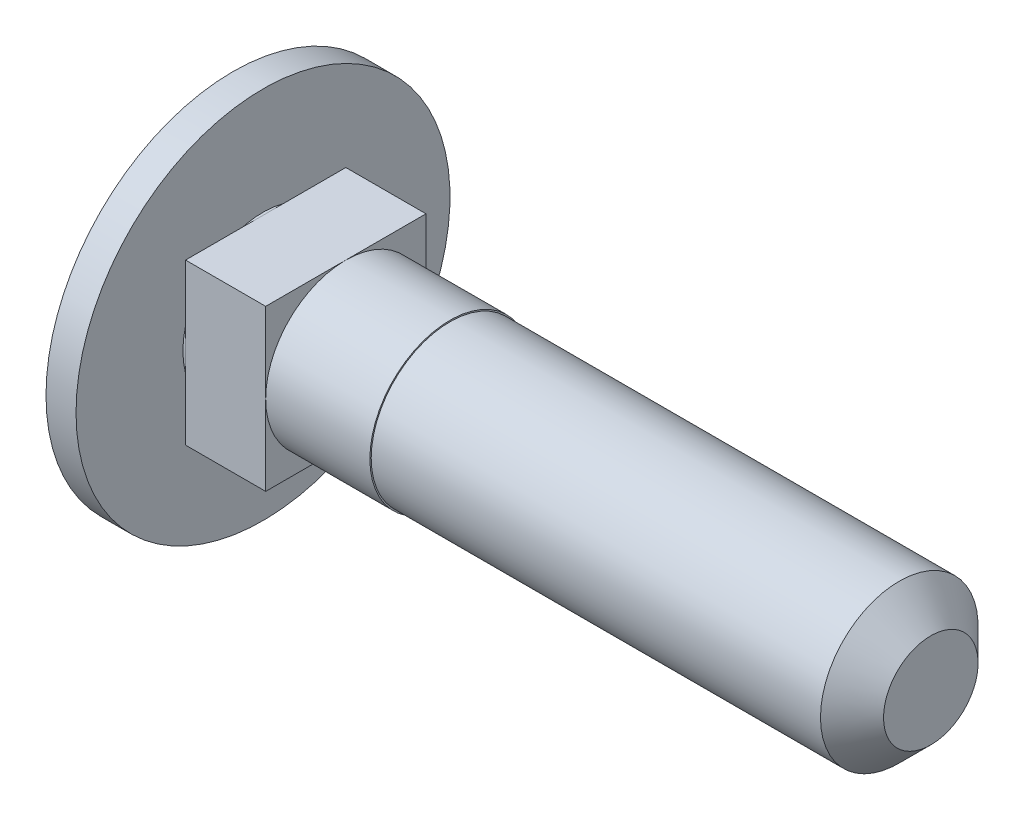
ISO-10303-21;
HEADER;
FILE_DESCRIPTION(('STEP AP214'),'2;1');
FILE_NAME('part.step','',(''),(''),'','','');
FILE_SCHEMA(('AUTOMOTIVE_DESIGN { 1 0 10303 214 1 1 1 1 }'));
ENDSEC;
DATA;
#1=APPLICATION_CONTEXT('core data for automotive mechanical design processes');
#2=APPLICATION_PROTOCOL_DEFINITION('international standard','automotive_design',2000,#1);
#3=PRODUCT_CONTEXT('',#1,'mechanical');
#4=PRODUCT('Part','Part','',(#3));
#5=PRODUCT_RELATED_PRODUCT_CATEGORY('part','',(#4));
#6=PRODUCT_DEFINITION_FORMATION('','',#4);
#7=PRODUCT_DEFINITION_CONTEXT('part definition',#1,'design');
#8=PRODUCT_DEFINITION('design','',#6,#7);
#9=PRODUCT_DEFINITION_SHAPE('','',#8);
#10=(LENGTH_UNIT() NAMED_UNIT(*) SI_UNIT(.MILLI.,.METRE.));
#11=(NAMED_UNIT(*) PLANE_ANGLE_UNIT() SI_UNIT($,.RADIAN.));
#12=(NAMED_UNIT(*) SI_UNIT($,.STERADIAN.) SOLID_ANGLE_UNIT());
#13=UNCERTAINTY_MEASURE_WITH_UNIT(LENGTH_MEASURE(1.E-05),#10,'distance_accuracy_value','');
#14=(GEOMETRIC_REPRESENTATION_CONTEXT(3) GLOBAL_UNCERTAINTY_ASSIGNED_CONTEXT((#13)) GLOBAL_UNIT_ASSIGNED_CONTEXT((#10,
#11,#12)) REPRESENTATION_CONTEXT('',''));
#15=CARTESIAN_POINT('',(0.,0.,0.));
#16=DIRECTION('',(0.,0.,1.));
#17=DIRECTION('',(1.,0.,0.));
#18=AXIS2_PLACEMENT_3D('',#15,#16,#17);
#19=CARTESIAN_POINT('',(25.,0.,0.));
#20=DIRECTION('',(-1.,0.,0.));
#21=DIRECTION('',(0.,0.,1.));
#22=AXIS2_PLACEMENT_3D('',#19,#20,#21);
#23=PLANE('',#22);
#24=CARTESIAN_POINT('',(25.,0.,0.));
#25=DIRECTION('',(-1.,0.,0.));
#26=DIRECTION('',(0.,0.,1.));
#27=AXIS2_PLACEMENT_3D('',#24,#25,#26);
#28=CIRCLE('',#27,1.77000000000004);
#29=CARTESIAN_POINT('',(25.,0.,1.77000000000004));
#30=VERTEX_POINT('',#29);
#31=EDGE_CURVE('E11',#30,#30,#28,.F.);
#32=ORIENTED_EDGE('',*,*,#31,.T.);
#33=EDGE_LOOP('',(#32));
#34=FACE_BOUND('',#33,.T.);
#35=ADVANCED_FACE('F36',(#34),#23,.F.);
#36=CARTESIAN_POINT('',(-121.430503084695,0.,0.));
#37=DIRECTION('',(-1.,0.,0.));
#38=DIRECTION('',(0.,0.,1.));
#39=AXIS2_PLACEMENT_3D('',#36,#37,#38);
#40=CYLINDRICAL_SURFACE('',#39,2.95000000000001);
#41=CARTESIAN_POINT('',(23.82,0.,0.));
#42=DIRECTION('',(-1.,0.,0.));
#43=DIRECTION('',(0.,0.,1.));
#44=AXIS2_PLACEMENT_3D('',#41,#42,#43);
#45=CIRCLE('',#44,2.95000000000001);
#46=CARTESIAN_POINT('',(23.82,0.,2.95000000000001));
#47=VERTEX_POINT('',#46);
#48=EDGE_CURVE('E44',#47,#47,#45,.T.);
#49=ORIENTED_EDGE('',*,*,#48,.T.);
#50=EDGE_LOOP('',(#49));
#51=FACE_BOUND('',#50,.T.);
#52=CARTESIAN_POINT('',(6.99999999999999,0.,0.));
#53=DIRECTION('',(-1.,0.,0.));
#54=DIRECTION('',(0.,0.,1.));
#55=AXIS2_PLACEMENT_3D('',#52,#53,#54);
#56=CIRCLE('',#55,2.95);
#57=CARTESIAN_POINT('',(6.99999999999999,0.,2.95));
#58=VERTEX_POINT('',#57);
#59=EDGE_CURVE('E146',#58,#58,#56,.T.);
#60=ORIENTED_EDGE('',*,*,#59,.F.);
#61=EDGE_LOOP('',(#60));
#62=FACE_BOUND('',#61,.T.);
#63=ADVANCED_FACE('F225',(#51,#62),#40,.T.);
#64=CARTESIAN_POINT('',(7.,2.95,0.));
#65=DIRECTION('',(-1.,0.,0.));
#66=DIRECTION('',(0.,0.,1.));
#67=AXIS2_PLACEMENT_3D('',#64,#65,#66);
#68=PLANE('',#67);
#69=CARTESIAN_POINT('',(6.99999999999999,0.,0.));
#70=DIRECTION('',(-1.,0.,0.));
#71=DIRECTION('',(0.,0.,1.));
#72=AXIS2_PLACEMENT_3D('',#69,#70,#71);
#73=CIRCLE('',#72,3.);
#74=CARTESIAN_POINT('',(6.99999999999999,0.,3.));
#75=VERTEX_POINT('',#74);
#76=EDGE_CURVE('E143',#75,#75,#73,.T.);
#77=ORIENTED_EDGE('',*,*,#76,.F.);
#78=EDGE_LOOP('',(#77));
#79=FACE_BOUND('',#78,.T.);
#80=ORIENTED_EDGE('',*,*,#59,.T.);
#81=EDGE_LOOP('',(#80));
#82=FACE_BOUND('',#81,.T.);
#83=ADVANCED_FACE('F230',(#79,#82),#68,.F.);
#84=CARTESIAN_POINT('',(-121.430503084695,0.,0.));
#85=DIRECTION('',(-1.,0.,0.));
#86=DIRECTION('',(0.,0.,1.));
#87=AXIS2_PLACEMENT_3D('',#84,#85,#86);
#88=CYLINDRICAL_SURFACE('',#87,3.00000000000001);
#89=CARTESIAN_POINT('',(3.10000000000001,0.,0.));
#90=DIRECTION('',(1.,0.,0.));
#91=DIRECTION('',(0.,0.,-1.));
#92=AXIS2_PLACEMENT_3D('',#89,#90,#91);
#93=CIRCLE('',#92,3.00000000000001);
#94=CARTESIAN_POINT('',(3.10000000000001,-3.,0.));
#95=VERTEX_POINT('',#94);
#96=CARTESIAN_POINT('',(3.10000000000001,0.,-3.00000000000001));
#97=VERTEX_POINT('',#96);
#98=EDGE_CURVE('E154',#95,#97,#93,.T.);
#99=ORIENTED_EDGE('',*,*,#98,.T.);
#100=CARTESIAN_POINT('',(3.10000000000001,3.,0.));
#101=VERTEX_POINT('',#100);
#102=EDGE_CURVE('E106',#97,#101,#93,.T.);
#103=ORIENTED_EDGE('',*,*,#102,.T.);
#104=CARTESIAN_POINT('',(3.10000000000001,0.,3.));
#105=VERTEX_POINT('',#104);
#106=EDGE_CURVE('E159',#101,#105,#93,.T.);
#107=ORIENTED_EDGE('',*,*,#106,.T.);
#108=EDGE_CURVE('E155',#105,#95,#93,.T.);
#109=ORIENTED_EDGE('',*,*,#108,.T.);
#110=EDGE_LOOP('',(#99,#103,#107,#109));
#111=FACE_BOUND('',#110,.T.);
#112=ORIENTED_EDGE('',*,*,#76,.T.);
#113=EDGE_LOOP('',(#112));
#114=FACE_BOUND('',#113,.T.);
#115=ADVANCED_FACE('F163',(#111,#114),#88,.T.);
#116=CARTESIAN_POINT('',(3.1,3.,-3.));
#117=DIRECTION('',(0.,0.,1.));
#118=DIRECTION('',(0.,-1.,0.));
#119=AXIS2_PLACEMENT_3D('',#116,#117,#118);
#120=PLANE('',#119);
#121=DIRECTION('',(0.,1.,0.));
#122=VECTOR('',#121,1.);
#123=CARTESIAN_POINT('',(3.1,3.,-3.));
#124=LINE('',#123,#122);
#125=CARTESIAN_POINT('',(3.1,3.,-3.));
#126=VERTEX_POINT('',#125);
#127=EDGE_CURVE('E101',#97,#126,#124,.T.);
#128=ORIENTED_EDGE('',*,*,#127,.F.);
#129=CARTESIAN_POINT('',(3.1,-3.,-3.));
#130=VERTEX_POINT('',#129);
#131=EDGE_CURVE('E51',#130,#97,#124,.T.);
#132=ORIENTED_EDGE('',*,*,#131,.F.);
#133=DIRECTION('',(-1.,0.,0.));
#134=VECTOR('',#133,1.);
#135=CARTESIAN_POINT('',(3.1,-3.,-3.));
#136=LINE('',#135,#134);
#137=CARTESIAN_POINT('',(0.1,-3.,-3.));
#138=VERTEX_POINT('',#137);
#139=EDGE_CURVE('E184',#130,#138,#136,.T.);
#140=ORIENTED_EDGE('',*,*,#139,.T.);
#141=DIRECTION('',(0.,1.,0.));
#142=VECTOR('',#141,1.);
#143=CARTESIAN_POINT('',(0.1,3.,-3.));
#144=LINE('',#143,#142);
#145=CARTESIAN_POINT('',(0.100000000000003,0.,-3.));
#146=VERTEX_POINT('',#145);
#147=EDGE_CURVE('E185',#138,#146,#144,.T.);
#148=ORIENTED_EDGE('',*,*,#147,.T.);
#149=CARTESIAN_POINT('',(0.1,3.,-3.));
#150=VERTEX_POINT('',#149);
#151=EDGE_CURVE('E125',#146,#150,#144,.T.);
#152=ORIENTED_EDGE('',*,*,#151,.T.);
#153=DIRECTION('',(-1.,0.,0.));
#154=VECTOR('',#153,1.);
#155=CARTESIAN_POINT('',(3.1,3.,-3.));
#156=LINE('',#155,#154);
#157=EDGE_CURVE('E117',#126,#150,#156,.T.);
#158=ORIENTED_EDGE('',*,*,#157,.F.);
#159=EDGE_LOOP('',(#128,#132,#140,#148,#152,#158));
#160=FACE_BOUND('',#159,.T.);
#161=ADVANCED_FACE('F122',(#160),#120,.F.);
#162=CARTESIAN_POINT('',(3.1,3.,3.));
#163=DIRECTION('',(0.,-1.,0.));
#164=DIRECTION('',(0.,0.,-1.));
#165=AXIS2_PLACEMENT_3D('',#162,#163,#164);
#166=PLANE('',#165);
#167=DIRECTION('',(0.,0.,1.));
#168=VECTOR('',#167,1.);
#169=CARTESIAN_POINT('',(3.1,3.,3.));
#170=LINE('',#169,#168);
#171=CARTESIAN_POINT('',(3.1,3.,3.));
#172=VERTEX_POINT('',#171);
#173=EDGE_CURVE('E119',#101,#172,#170,.T.);
#174=ORIENTED_EDGE('',*,*,#173,.F.);
#175=EDGE_CURVE('E104',#126,#101,#170,.T.);
#176=ORIENTED_EDGE('',*,*,#175,.F.);
#177=ORIENTED_EDGE('',*,*,#157,.T.);
#178=DIRECTION('',(0.,0.,1.));
#179=VECTOR('',#178,1.);
#180=CARTESIAN_POINT('',(0.1,3.,3.));
#181=LINE('',#180,#179);
#182=CARTESIAN_POINT('',(0.100000000000003,3.,0.));
#183=VERTEX_POINT('',#182);
#184=EDGE_CURVE('E188',#150,#183,#181,.T.);
#185=ORIENTED_EDGE('',*,*,#184,.T.);
#186=CARTESIAN_POINT('',(0.1,3.,3.));
#187=VERTEX_POINT('',#186);
#188=EDGE_CURVE('E187',#183,#187,#181,.T.);
#189=ORIENTED_EDGE('',*,*,#188,.T.);
#190=DIRECTION('',(-1.,0.,0.));
#191=VECTOR('',#190,1.);
#192=CARTESIAN_POINT('',(3.1,3.,3.));
#193=LINE('',#192,#191);
#194=EDGE_CURVE('E128',#172,#187,#193,.T.);
#195=ORIENTED_EDGE('',*,*,#194,.F.);
#196=EDGE_LOOP('',(#174,#176,#177,#185,#189,#195));
#197=FACE_BOUND('',#196,.T.);
#198=ADVANCED_FACE('F115',(#197),#166,.F.);
#199=CARTESIAN_POINT('',(3.1,3.,3.));
#200=DIRECTION('',(0.,0.,-1.));
#201=DIRECTION('',(0.,1.,0.));
#202=AXIS2_PLACEMENT_3D('',#199,#200,#201);
#203=PLANE('',#202);
#204=DIRECTION('',(0.,-1.,0.));
#205=VECTOR('',#204,1.);
#206=CARTESIAN_POINT('',(3.1,3.,3.));
#207=LINE('',#206,#205);
#208=CARTESIAN_POINT('',(3.1,-3.,3.));
#209=VERTEX_POINT('',#208);
#210=EDGE_CURVE('E120',#105,#209,#207,.T.);
#211=ORIENTED_EDGE('',*,*,#210,.F.);
#212=EDGE_CURVE('E176',#172,#105,#207,.T.);
#213=ORIENTED_EDGE('',*,*,#212,.F.);
#214=ORIENTED_EDGE('',*,*,#194,.T.);
#215=DIRECTION('',(0.,-1.,0.));
#216=VECTOR('',#215,1.);
#217=CARTESIAN_POINT('',(0.1,3.,3.));
#218=LINE('',#217,#216);
#219=CARTESIAN_POINT('',(0.100000000000003,0.,3.));
#220=VERTEX_POINT('',#219);
#221=EDGE_CURVE('E191',#187,#220,#218,.T.);
#222=ORIENTED_EDGE('',*,*,#221,.T.);
#223=CARTESIAN_POINT('',(0.1,-3.,3.));
#224=VERTEX_POINT('',#223);
#225=EDGE_CURVE('E190',#220,#224,#218,.T.);
#226=ORIENTED_EDGE('',*,*,#225,.T.);
#227=DIRECTION('',(-1.,0.,0.));
#228=VECTOR('',#227,1.);
#229=CARTESIAN_POINT('',(3.1,-3.,3.));
#230=LINE('',#229,#228);
#231=EDGE_CURVE('E134',#209,#224,#230,.T.);
#232=ORIENTED_EDGE('',*,*,#231,.F.);
#233=EDGE_LOOP('',(#211,#213,#214,#222,#226,#232));
#234=FACE_BOUND('',#233,.T.);
#235=ADVANCED_FACE('F175',(#234),#203,.F.);
#236=CARTESIAN_POINT('',(3.1,-3.,3.));
#237=DIRECTION('',(0.,1.,0.));
#238=DIRECTION('',(0.,0.,1.));
#239=AXIS2_PLACEMENT_3D('',#236,#237,#238);
#240=PLANE('',#239);
#241=DIRECTION('',(0.,0.,-1.));
#242=VECTOR('',#241,1.);
#243=CARTESIAN_POINT('',(3.1,-3.,3.));
#244=LINE('',#243,#242);
#245=EDGE_CURVE('E181',#95,#130,#244,.T.);
#246=ORIENTED_EDGE('',*,*,#245,.F.);
#247=EDGE_CURVE('E171',#209,#95,#244,.T.);
#248=ORIENTED_EDGE('',*,*,#247,.F.);
#249=ORIENTED_EDGE('',*,*,#231,.T.);
#250=DIRECTION('',(0.,0.,-1.));
#251=VECTOR('',#250,1.);
#252=CARTESIAN_POINT('',(0.1,-3.,3.));
#253=LINE('',#252,#251);
#254=CARTESIAN_POINT('',(0.100000000000003,-3.,0.));
#255=VERTEX_POINT('',#254);
#256=EDGE_CURVE('E110',#224,#255,#253,.T.);
#257=ORIENTED_EDGE('',*,*,#256,.T.);
#258=EDGE_CURVE('E194',#255,#138,#253,.T.);
#259=ORIENTED_EDGE('',*,*,#258,.T.);
#260=ORIENTED_EDGE('',*,*,#139,.F.);
#261=EDGE_LOOP('',(#246,#248,#249,#257,#259,#260));
#262=FACE_BOUND('',#261,.T.);
#263=ADVANCED_FACE('F201',(#262),#240,.F.);
#264=CARTESIAN_POINT('',(3.1,0.,0.));
#265=DIRECTION('',(1.,0.,0.));
#266=DIRECTION('',(0.,0.,-1.));
#267=AXIS2_PLACEMENT_3D('',#264,#265,#266);
#268=PLANE('',#267);
#269=ORIENTED_EDGE('',*,*,#102,.F.);
#270=ORIENTED_EDGE('',*,*,#127,.T.);
#271=ORIENTED_EDGE('',*,*,#175,.T.);
#272=EDGE_LOOP('',(#269,#270,#271));
#273=FACE_BOUND('',#272,.T.);
#274=ADVANCED_FACE('F103',(#273),#268,.T.);
#275=ORIENTED_EDGE('',*,*,#106,.F.);
#276=ORIENTED_EDGE('',*,*,#173,.T.);
#277=ORIENTED_EDGE('',*,*,#212,.T.);
#278=EDGE_LOOP('',(#275,#276,#277));
#279=FACE_BOUND('',#278,.T.);
#280=ADVANCED_FACE('F180',(#279),#268,.T.);
#281=ORIENTED_EDGE('',*,*,#108,.F.);
#282=ORIENTED_EDGE('',*,*,#210,.T.);
#283=ORIENTED_EDGE('',*,*,#247,.T.);
#284=EDGE_LOOP('',(#281,#282,#283));
#285=FACE_BOUND('',#284,.T.);
#286=ADVANCED_FACE('F168',(#285),#268,.T.);
#287=CARTESIAN_POINT('',(0.1,0.,0.));
#288=DIRECTION('',(1.,0.,0.));
#289=DIRECTION('',(0.,0.,-1.));
#290=AXIS2_PLACEMENT_3D('',#287,#288,#289);
#291=PLANE('',#290);
#292=ORIENTED_EDGE('',*,*,#151,.F.);
#293=CARTESIAN_POINT('',(0.100000000000003,0.,0.));
#294=DIRECTION('',(1.,0.,0.));
#295=DIRECTION('',(0.,0.,-1.));
#296=AXIS2_PLACEMENT_3D('',#293,#294,#295);
#297=CIRCLE('',#296,3.00000000000001);
#298=EDGE_CURVE('E153',#146,#183,#297,.T.);
#299=ORIENTED_EDGE('',*,*,#298,.T.);
#300=ORIENTED_EDGE('',*,*,#184,.F.);
#301=EDGE_LOOP('',(#292,#299,#300));
#302=FACE_BOUND('',#301,.T.);
#303=ADVANCED_FACE('F220',(#302),#291,.F.);
#304=ORIENTED_EDGE('',*,*,#188,.F.);
#305=EDGE_CURVE('E59',#183,#220,#297,.T.);
#306=ORIENTED_EDGE('',*,*,#305,.T.);
#307=ORIENTED_EDGE('',*,*,#221,.F.);
#308=EDGE_LOOP('',(#304,#306,#307));
#309=FACE_BOUND('',#308,.T.);
#310=ADVANCED_FACE('F221',(#309),#291,.F.);
#311=ORIENTED_EDGE('',*,*,#225,.F.);
#312=EDGE_CURVE('E152',#220,#255,#297,.T.);
#313=ORIENTED_EDGE('',*,*,#312,.T.);
#314=ORIENTED_EDGE('',*,*,#256,.F.);
#315=EDGE_LOOP('',(#311,#313,#314));
#316=FACE_BOUND('',#315,.T.);
#317=ADVANCED_FACE('F205',(#316),#291,.F.);
#318=ORIENTED_EDGE('',*,*,#98,.F.);
#319=ORIENTED_EDGE('',*,*,#245,.T.);
#320=ORIENTED_EDGE('',*,*,#131,.T.);
#321=EDGE_LOOP('',(#318,#319,#320));
#322=FACE_BOUND('',#321,.T.);
#323=ADVANCED_FACE('F211',(#322),#268,.T.);
#324=ORIENTED_EDGE('',*,*,#258,.F.);
#325=EDGE_CURVE('E149',#255,#146,#297,.T.);
#326=ORIENTED_EDGE('',*,*,#325,.T.);
#327=ORIENTED_EDGE('',*,*,#147,.F.);
#328=EDGE_LOOP('',(#324,#326,#327));
#329=FACE_BOUND('',#328,.T.);
#330=ADVANCED_FACE('F209',(#329),#291,.F.);
#331=CARTESIAN_POINT('',(11.,0.,0.));
#332=DIRECTION('',(-1.,0.,0.));
#333=DIRECTION('',(0.,1.,0.));
#334=AXIS2_PLACEMENT_3D('',#331,#332,#333);
#335=SPHERICAL_SURFACE('',#334,14.);
#336=CARTESIAN_POINT('',(-1.12435565298215,0.,0.));
#337=DIRECTION('',(-1.,0.,0.));
#338=DIRECTION('',(0.,0.,1.));
#339=AXIS2_PLACEMENT_3D('',#336,#337,#338);
#340=CIRCLE('',#339,7.);
#341=CARTESIAN_POINT('',(-1.12435565298215,0.,7.));
#342=VERTEX_POINT('',#341);
#343=EDGE_CURVE('E127',#342,#342,#340,.T.);
#344=ORIENTED_EDGE('',*,*,#343,.T.);
#345=EDGE_LOOP('',(#344));
#346=FACE_BOUND('',#345,.T.);
#347=ADVANCED_FACE('F218',(#346),#335,.T.);
#348=CARTESIAN_POINT('',(-121.430503084695,0.,0.));
#349=DIRECTION('',(-1.,0.,0.));
#350=DIRECTION('',(0.,0.,1.));
#351=AXIS2_PLACEMENT_3D('',#348,#349,#350);
#352=CYLINDRICAL_SURFACE('',#351,7.);
#353=ORIENTED_EDGE('',*,*,#343,.F.);
#354=EDGE_LOOP('',(#353));
#355=FACE_BOUND('',#354,.T.);
#356=CARTESIAN_POINT('',(0.,0.,0.));
#357=DIRECTION('',(-1.,0.,0.));
#358=DIRECTION('',(0.,0.,1.));
#359=AXIS2_PLACEMENT_3D('',#356,#357,#358);
#360=CIRCLE('',#359,7.);
#361=CARTESIAN_POINT('',(0.,0.,7.));
#362=VERTEX_POINT('',#361);
#363=EDGE_CURVE('E131',#362,#362,#360,.T.);
#364=ORIENTED_EDGE('',*,*,#363,.T.);
#365=EDGE_LOOP('',(#364));
#366=FACE_BOUND('',#365,.T.);
#367=ADVANCED_FACE('F242',(#355,#366),#352,.T.);
#368=CARTESIAN_POINT('',(0.,3.00000000000002,0.));
#369=DIRECTION('',(-1.,0.,0.));
#370=DIRECTION('',(0.,0.,1.));
#371=AXIS2_PLACEMENT_3D('',#368,#369,#370);
#372=PLANE('',#371);
#373=ORIENTED_EDGE('',*,*,#363,.F.);
#374=EDGE_LOOP('',(#373));
#375=FACE_BOUND('',#374,.T.);
#376=CARTESIAN_POINT('',(0.,0.,0.));
#377=DIRECTION('',(-1.,0.,0.));
#378=DIRECTION('',(0.,0.,1.));
#379=AXIS2_PLACEMENT_3D('',#376,#377,#378);
#380=CIRCLE('',#379,3.00000000000002);
#381=CARTESIAN_POINT('',(0.,0.,3.00000000000002));
#382=VERTEX_POINT('',#381);
#383=EDGE_CURVE('E140',#382,#382,#380,.T.);
#384=ORIENTED_EDGE('',*,*,#383,.T.);
#385=EDGE_LOOP('',(#384));
#386=FACE_BOUND('',#385,.T.);
#387=ADVANCED_FACE('F239',(#375,#386),#372,.F.);
#388=ORIENTED_EDGE('',*,*,#383,.F.);
#389=EDGE_LOOP('',(#388));
#390=FACE_BOUND('',#389,.T.);
#391=ORIENTED_EDGE('',*,*,#298,.F.);
#392=ORIENTED_EDGE('',*,*,#325,.F.);
#393=ORIENTED_EDGE('',*,*,#312,.F.);
#394=ORIENTED_EDGE('',*,*,#305,.F.);
#395=EDGE_LOOP('',(#391,#392,#393,#394));
#396=FACE_BOUND('',#395,.T.);
#397=ADVANCED_FACE('F238',(#390,#396),#88,.T.);
#398=CARTESIAN_POINT('',(23.82,0.,0.));
#399=DIRECTION('',(-1.,0.,0.));
#400=DIRECTION('',(0.,0.,1.));
#401=AXIS2_PLACEMENT_3D('',#398,#399,#400);
#402=CONICAL_SURFACE('',#401,2.95000000000001,0.785398163397447);
#403=ORIENTED_EDGE('',*,*,#31,.F.);
#404=EDGE_LOOP('',(#403));
#405=FACE_BOUND('',#404,.T.);
#406=ORIENTED_EDGE('',*,*,#48,.F.);
#407=EDGE_LOOP('',(#406));
#408=FACE_BOUND('',#407,.T.);
#409=ADVANCED_FACE('F38',(#405,#408),#402,.T.);
#410=CLOSED_SHELL('',(#35,#63,#83,#115,#161,#198,#235,#263,#274,#280,#286,#303,#310,#317,#323,
#330,#347,#367,#387,#397,#409));
#411=MANIFOLD_SOLID_BREP('B2',#410);
#412=ADVANCED_BREP_SHAPE_REPRESENTATION('',(#18,#411),#14);
#413=SHAPE_DEFINITION_REPRESENTATION(#9,#412);
ENDSEC;
END-ISO-10303-21;
